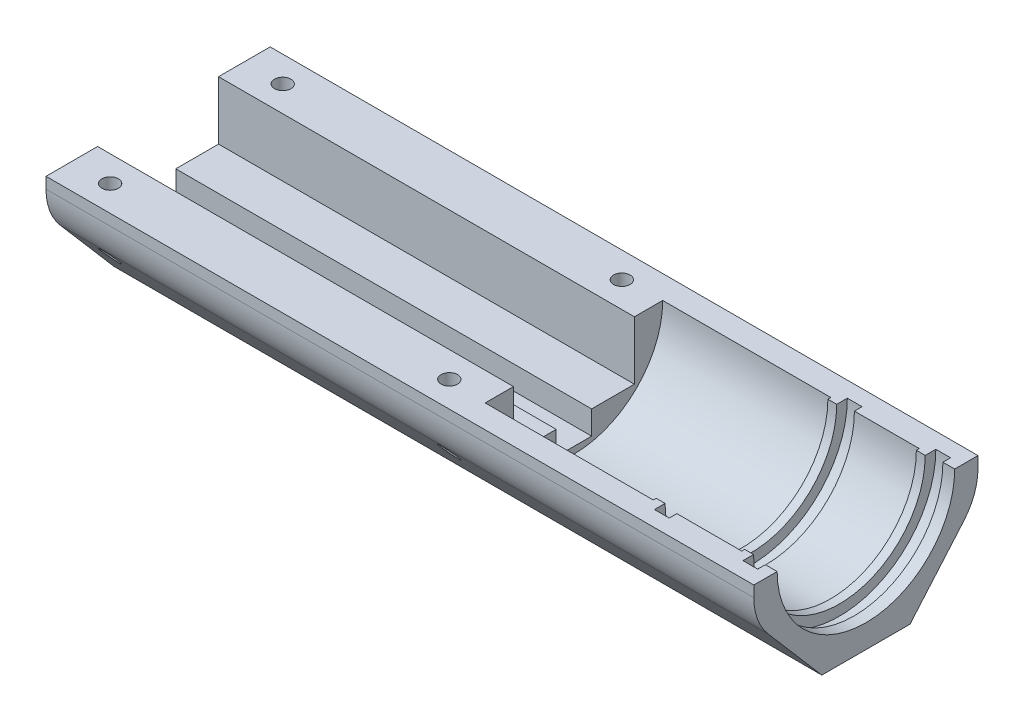
ISO-10303-21;
HEADER;
FILE_DESCRIPTION(('STEP AP214'),'2;1');
FILE_NAME('part.step','',(''),(''),'','','');
FILE_SCHEMA(('AUTOMOTIVE_DESIGN { 1 0 10303 214 1 1 1 1 }'));
ENDSEC;
DATA;
#1=APPLICATION_CONTEXT('core data for automotive mechanical design processes');
#2=APPLICATION_PROTOCOL_DEFINITION('international standard','automotive_design',2000,#1);
#3=PRODUCT_CONTEXT('',#1,'mechanical');
#4=PRODUCT('Part','Part','',(#3));
#5=PRODUCT_RELATED_PRODUCT_CATEGORY('part','',(#4));
#6=PRODUCT_DEFINITION_FORMATION('','',#4);
#7=PRODUCT_DEFINITION_CONTEXT('part definition',#1,'design');
#8=PRODUCT_DEFINITION('design','',#6,#7);
#9=PRODUCT_DEFINITION_SHAPE('','',#8);
#10=(LENGTH_UNIT() NAMED_UNIT(*) SI_UNIT(.MILLI.,.METRE.));
#11=(NAMED_UNIT(*) PLANE_ANGLE_UNIT() SI_UNIT($,.RADIAN.));
#12=(NAMED_UNIT(*) SI_UNIT($,.STERADIAN.) SOLID_ANGLE_UNIT());
#13=UNCERTAINTY_MEASURE_WITH_UNIT(LENGTH_MEASURE(1.E-05),#10,'distance_accuracy_value','');
#14=(GEOMETRIC_REPRESENTATION_CONTEXT(3) GLOBAL_UNCERTAINTY_ASSIGNED_CONTEXT((#13)) GLOBAL_UNIT_ASSIGNED_CONTEXT((#10,
#11,#12)) REPRESENTATION_CONTEXT('',''));
#15=CARTESIAN_POINT('',(0.,0.,0.));
#16=DIRECTION('',(0.,0.,1.));
#17=DIRECTION('',(1.,0.,0.));
#18=AXIS2_PLACEMENT_3D('',#15,#16,#17);
#19=CARTESIAN_POINT('',(0.,0.,-15.05));
#20=DIRECTION('',(-1.,0.,0.));
#21=DIRECTION('',(0.,0.,1.));
#22=AXIS2_PLACEMENT_3D('',#19,#20,#21);
#23=PLANE('',#22);
#24=DIRECTION('',(0.,1.,0.));
#25=VECTOR('',#24,1.);
#26=CARTESIAN_POINT('',(0.,0.,10.25));
#27=LINE('',#26,#25);
#28=CARTESIAN_POINT('',(0.,-9.90000000000001,10.25));
#29=VERTEX_POINT('',#28);
#30=CARTESIAN_POINT('',(0.,0.,10.25));
#31=VERTEX_POINT('',#30);
#32=EDGE_CURVE('E50',#29,#31,#27,.T.);
#33=ORIENTED_EDGE('',*,*,#32,.F.);
#34=DIRECTION('',(0.,0.,1.));
#35=VECTOR('',#34,1.);
#36=CARTESIAN_POINT('',(0.,-9.90000000000001,10.25));
#37=LINE('',#36,#35);
#38=CARTESIAN_POINT('',(0.,-9.89999999999999,3.));
#39=VERTEX_POINT('',#38);
#40=EDGE_CURVE('E390',#39,#29,#37,.T.);
#41=ORIENTED_EDGE('',*,*,#40,.F.);
#42=DIRECTION('',(0.,1.,0.));
#43=VECTOR('',#42,1.);
#44=CARTESIAN_POINT('',(0.,-9.89999999999999,3.));
#45=LINE('',#44,#43);
#46=CARTESIAN_POINT('',(0.,-13.9,3.));
#47=VERTEX_POINT('',#46);
#48=EDGE_CURVE('E387',#47,#39,#45,.T.);
#49=ORIENTED_EDGE('',*,*,#48,.F.);
#50=DIRECTION('',(0.,0.,1.));
#51=VECTOR('',#50,1.);
#52=CARTESIAN_POINT('',(0.,-13.9,-3.));
#53=LINE('',#52,#51);
#54=CARTESIAN_POINT('',(0.,-13.9,-3.));
#55=VERTEX_POINT('',#54);
#56=EDGE_CURVE('E384',#55,#47,#53,.T.);
#57=ORIENTED_EDGE('',*,*,#56,.F.);
#58=DIRECTION('',(0.,-1.,0.));
#59=VECTOR('',#58,1.);
#60=CARTESIAN_POINT('',(0.,-9.9,-2.99999999999999));
#61=LINE('',#60,#59);
#62=CARTESIAN_POINT('',(0.,-9.9,-2.99999999999999));
#63=VERTEX_POINT('',#62);
#64=EDGE_CURVE('E381',#63,#55,#61,.T.);
#65=ORIENTED_EDGE('',*,*,#64,.F.);
#66=DIRECTION('',(0.,0.,1.));
#67=VECTOR('',#66,1.);
#68=CARTESIAN_POINT('',(0.,-9.9,-2.99999999999999));
#69=LINE('',#68,#67);
#70=CARTESIAN_POINT('',(0.,-9.90000000000001,-10.25));
#71=VERTEX_POINT('',#70);
#72=EDGE_CURVE('E252',#71,#63,#69,.T.);
#73=ORIENTED_EDGE('',*,*,#72,.F.);
#74=DIRECTION('',(0.,-1.,0.));
#75=VECTOR('',#74,1.);
#76=CARTESIAN_POINT('',(0.,0.,-10.25));
#77=LINE('',#76,#75);
#78=CARTESIAN_POINT('',(0.,0.,-10.25));
#79=VERTEX_POINT('',#78);
#80=EDGE_CURVE('E236',#79,#71,#77,.T.);
#81=ORIENTED_EDGE('',*,*,#80,.F.);
#82=DIRECTION('',(0.,0.,-1.));
#83=VECTOR('',#82,1.);
#84=CARTESIAN_POINT('',(0.,0.,-15.05));
#85=LINE('',#84,#83);
#86=CARTESIAN_POINT('',(0.,0.,-19.));
#87=VERTEX_POINT('',#86);
#88=EDGE_CURVE('E248',#79,#87,#85,.T.);
#89=ORIENTED_EDGE('',*,*,#88,.T.);
#90=DIRECTION('',(0.,1.,0.));
#91=VECTOR('',#90,1.);
#92=CARTESIAN_POINT('',(0.,0.,-19.));
#93=LINE('',#92,#91);
#94=CARTESIAN_POINT('',(0.,-1.87765266245654,-19.));
#95=VERTEX_POINT('',#94);
#96=EDGE_CURVE('E430',#95,#87,#93,.T.);
#97=ORIENTED_EDGE('',*,*,#96,.F.);
#98=CARTESIAN_POINT('',(0.,-1.87765266245654,-9.));
#99=DIRECTION('',(-1.,0.,0.));
#100=DIRECTION('',(0.,0.,1.));
#101=AXIS2_PLACEMENT_3D('',#98,#99,#100);
#102=CIRCLE('',#101,10.);
#103=CARTESIAN_POINT('',(0.,-8.39458052178645,-16.5848303393214));
#104=VERTEX_POINT('',#103);
#105=EDGE_CURVE('E340',#95,#104,#102,.T.);
#106=ORIENTED_EDGE('',*,*,#105,.T.);
#107=DIRECTION('',(0.,-0.758483033932136,0.651692785932991));
#108=VECTOR('',#107,1.);
#109=CARTESIAN_POINT('',(0.,-4.32387106802505,-20.0824062453935));
#110=LINE('',#109,#108);
#111=CARTESIAN_POINT('',(0.,-19.0000000000001,-7.47259571237857));
#112=VERTEX_POINT('',#111);
#113=EDGE_CURVE('E422',#104,#112,#110,.T.);
#114=ORIENTED_EDGE('',*,*,#113,.T.);
#115=DIRECTION('',(0.,0.,1.));
#116=VECTOR('',#115,1.);
#117=CARTESIAN_POINT('',(0.,-18.9999999999999,25.0500000000001));
#118=LINE('',#117,#116);
#119=CARTESIAN_POINT('',(0.,-19.,7.4725957123786));
#120=VERTEX_POINT('',#119);
#121=EDGE_CURVE('E432',#112,#120,#118,.T.);
#122=ORIENTED_EDGE('',*,*,#121,.T.);
#123=DIRECTION('',(0.,0.758483033932136,0.651692785932991));
#124=VECTOR('',#123,1.);
#125=CARTESIAN_POINT('',(0.,-19.2022385041559,7.2988312795567));
#126=LINE('',#125,#124);
#127=CARTESIAN_POINT('',(0.,-8.39458052178646,16.5848303393214));
#128=VERTEX_POINT('',#127);
#129=EDGE_CURVE('E410',#120,#128,#126,.T.);
#130=ORIENTED_EDGE('',*,*,#129,.T.);
#131=CARTESIAN_POINT('',(0.,-1.87765266245654,9.));
#132=DIRECTION('',(-1.,0.,0.));
#133=DIRECTION('',(0.,0.,1.));
#134=AXIS2_PLACEMENT_3D('',#131,#132,#133);
#135=CIRCLE('',#134,10.);
#136=CARTESIAN_POINT('',(0.,-1.87765266245654,19.));
#137=VERTEX_POINT('',#136);
#138=EDGE_CURVE('E58',#128,#137,#135,.T.);
#139=ORIENTED_EDGE('',*,*,#138,.T.);
#140=DIRECTION('',(0.,-1.,0.));
#141=VECTOR('',#140,1.);
#142=CARTESIAN_POINT('',(0.,0.,19.));
#143=LINE('',#142,#141);
#144=CARTESIAN_POINT('',(0.,0.,19.));
#145=VERTEX_POINT('',#144);
#146=EDGE_CURVE('E417',#145,#137,#143,.T.);
#147=ORIENTED_EDGE('',*,*,#146,.F.);
#148=DIRECTION('',(0.,0.,1.));
#149=VECTOR('',#148,1.);
#150=CARTESIAN_POINT('',(0.,0.,15.05));
#151=LINE('',#150,#149);
#152=EDGE_CURVE('E447',#31,#145,#151,.T.);
#153=ORIENTED_EDGE('',*,*,#152,.F.);
#154=EDGE_LOOP('',(#33,#41,#49,#57,#65,#73,#81,#89,#97,#106,#114,#122,#130,#139,#147,#153));
#155=FACE_BOUND('',#154,.T.);
#156=ADVANCED_FACE('F33',(#155),#23,.T.);
#157=CARTESIAN_POINT('',(120.,0.,-15.05));
#158=DIRECTION('',(1.,0.,0.));
#159=DIRECTION('',(0.,0.,-1.));
#160=AXIS2_PLACEMENT_3D('',#157,#158,#159);
#161=PLANE('',#160);
#162=DIRECTION('',(0.,0.758483033932136,-0.651692785932991));
#163=VECTOR('',#162,1.);
#164=CARTESIAN_POINT('',(120.,-4.32387106802505,-20.0824062453935));
#165=LINE('',#164,#163);
#166=CARTESIAN_POINT('',(120.,-19.0000000000001,-7.47259571237857));
#167=VERTEX_POINT('',#166);
#168=CARTESIAN_POINT('',(120.,-8.39458052178645,-16.5848303393214));
#169=VERTEX_POINT('',#168);
#170=EDGE_CURVE('E419',#167,#169,#165,.T.);
#171=ORIENTED_EDGE('',*,*,#170,.T.);
#172=CARTESIAN_POINT('',(120.,-1.87765266245654,-9.));
#173=DIRECTION('',(1.,0.,0.));
#174=DIRECTION('',(0.,0.,-1.));
#175=AXIS2_PLACEMENT_3D('',#172,#173,#174);
#176=CIRCLE('',#175,10.);
#177=CARTESIAN_POINT('',(120.,-1.87765266245654,-19.));
#178=VERTEX_POINT('',#177);
#179=EDGE_CURVE('E335',#169,#178,#176,.T.);
#180=ORIENTED_EDGE('',*,*,#179,.T.);
#181=DIRECTION('',(0.,-1.,0.));
#182=VECTOR('',#181,1.);
#183=CARTESIAN_POINT('',(120.,0.,-19.));
#184=LINE('',#183,#182);
#185=CARTESIAN_POINT('',(120.,0.,-19.));
#186=VERTEX_POINT('',#185);
#187=EDGE_CURVE('E427',#186,#178,#184,.T.);
#188=ORIENTED_EDGE('',*,*,#187,.F.);
#189=DIRECTION('',(0.,0.,1.));
#190=VECTOR('',#189,1.);
#191=CARTESIAN_POINT('',(120.,0.,-15.05));
#192=LINE('',#191,#190);
#193=CARTESIAN_POINT('',(120.,0.,-15.05));
#194=VERTEX_POINT('',#193);
#195=EDGE_CURVE('E258',#186,#194,#192,.T.);
#196=ORIENTED_EDGE('',*,*,#195,.T.);
#197=CARTESIAN_POINT('',(120.,0.,0.));
#198=DIRECTION('',(-1.,0.,0.));
#199=DIRECTION('',(0.,0.,1.));
#200=AXIS2_PLACEMENT_3D('',#197,#198,#199);
#201=CIRCLE('',#200,15.05);
#202=CARTESIAN_POINT('',(120.,0.,15.05));
#203=VERTEX_POINT('',#202);
#204=EDGE_CURVE('E311',#194,#203,#201,.T.);
#205=ORIENTED_EDGE('',*,*,#204,.T.);
#206=DIRECTION('',(0.,0.,-1.));
#207=VECTOR('',#206,1.);
#208=CARTESIAN_POINT('',(120.,0.,15.05));
#209=LINE('',#208,#207);
#210=CARTESIAN_POINT('',(120.,0.,19.));
#211=VERTEX_POINT('',#210);
#212=EDGE_CURVE('E449',#211,#203,#209,.T.);
#213=ORIENTED_EDGE('',*,*,#212,.F.);
#214=DIRECTION('',(0.,1.,0.));
#215=VECTOR('',#214,1.);
#216=CARTESIAN_POINT('',(120.,0.,19.));
#217=LINE('',#216,#215);
#218=CARTESIAN_POINT('',(120.,-1.87765266245654,19.));
#219=VERTEX_POINT('',#218);
#220=EDGE_CURVE('E415',#219,#211,#217,.T.);
#221=ORIENTED_EDGE('',*,*,#220,.F.);
#222=CARTESIAN_POINT('',(120.,-1.87765266245654,9.));
#223=DIRECTION('',(1.,0.,0.));
#224=DIRECTION('',(0.,0.,-1.));
#225=AXIS2_PLACEMENT_3D('',#222,#223,#224);
#226=CIRCLE('',#225,10.);
#227=CARTESIAN_POINT('',(120.,-8.39458052178645,16.5848303393214));
#228=VERTEX_POINT('',#227);
#229=EDGE_CURVE('E333',#219,#228,#226,.T.);
#230=ORIENTED_EDGE('',*,*,#229,.T.);
#231=DIRECTION('',(0.,-0.758483033932136,-0.651692785932991));
#232=VECTOR('',#231,1.);
#233=CARTESIAN_POINT('',(120.,-19.2022385041559,7.2988312795567));
#234=LINE('',#233,#232);
#235=CARTESIAN_POINT('',(120.,-19.,7.4725957123786));
#236=VERTEX_POINT('',#235);
#237=EDGE_CURVE('E408',#228,#236,#234,.T.);
#238=ORIENTED_EDGE('',*,*,#237,.T.);
#239=DIRECTION('',(0.,0.,1.));
#240=VECTOR('',#239,1.);
#241=CARTESIAN_POINT('',(120.,-19.0000000000001,-15.0499999999999));
#242=LINE('',#241,#240);
#243=EDGE_CURVE('E323',#167,#236,#242,.T.);
#244=ORIENTED_EDGE('',*,*,#243,.F.);
#245=EDGE_LOOP('',(#171,#180,#188,#196,#205,#213,#221,#230,#238,#244));
#246=FACE_BOUND('',#245,.T.);
#247=ADVANCED_FACE('F553',(#246),#161,.T.);
#248=CARTESIAN_POINT('',(0.,-19.,0.));
#249=DIRECTION('',(0.,1.,0.));
#250=DIRECTION('',(0.,0.,1.));
#251=AXIS2_PLACEMENT_3D('',#248,#249,#250);
#252=PLANE('',#251);
#253=DIRECTION('',(1.,0.,0.));
#254=VECTOR('',#253,1.);
#255=CARTESIAN_POINT('',(0.,-19.,7.47259571237864));
#256=LINE('',#255,#254);
#257=EDGE_CURVE('E412',#120,#236,#256,.T.);
#258=ORIENTED_EDGE('',*,*,#257,.F.);
#259=ORIENTED_EDGE('',*,*,#121,.F.);
#260=DIRECTION('',(-1.,0.,0.));
#261=VECTOR('',#260,1.);
#262=CARTESIAN_POINT('',(0.,-19.,-7.4725957123786));
#263=LINE('',#262,#261);
#264=EDGE_CURVE('E424',#167,#112,#263,.T.);
#265=ORIENTED_EDGE('',*,*,#264,.F.);
#266=ORIENTED_EDGE('',*,*,#243,.T.);
#267=EDGE_LOOP('',(#258,#259,#265,#266));
#268=FACE_BOUND('',#267,.T.);
#269=ADVANCED_FACE('F571',(#268),#252,.F.);
#270=CARTESIAN_POINT('',(0.,0.,19.));
#271=DIRECTION('',(0.,0.,-1.));
#272=DIRECTION('',(1.,0.,0.));
#273=AXIS2_PLACEMENT_3D('',#270,#271,#272);
#274=PLANE('',#273);
#275=ORIENTED_EDGE('',*,*,#146,.T.);
#276=DIRECTION('',(-1.,0.,0.));
#277=VECTOR('',#276,1.);
#278=CARTESIAN_POINT('',(120.,-1.87765266245654,19.));
#279=LINE('',#278,#277);
#280=EDGE_CURVE('E345',#137,#219,#279,.F.);
#281=ORIENTED_EDGE('',*,*,#280,.T.);
#282=ORIENTED_EDGE('',*,*,#220,.T.);
#283=DIRECTION('',(-1.,0.,0.));
#284=VECTOR('',#283,1.);
#285=CARTESIAN_POINT('',(0.,0.,19.));
#286=LINE('',#285,#284);
#287=EDGE_CURVE('E327',#211,#145,#286,.T.);
#288=ORIENTED_EDGE('',*,*,#287,.T.);
#289=EDGE_LOOP('',(#275,#281,#282,#288));
#290=FACE_BOUND('',#289,.T.);
#291=ADVANCED_FACE('F580',(#290),#274,.F.);
#292=CARTESIAN_POINT('',(0.,0.,-19.));
#293=DIRECTION('',(0.,0.,1.));
#294=DIRECTION('',(1.,0.,0.));
#295=AXIS2_PLACEMENT_3D('',#292,#293,#294);
#296=PLANE('',#295);
#297=ORIENTED_EDGE('',*,*,#187,.T.);
#298=DIRECTION('',(1.,0.,0.));
#299=VECTOR('',#298,1.);
#300=CARTESIAN_POINT('',(0.,-1.87765266245654,-19.));
#301=LINE('',#300,#299);
#302=EDGE_CURVE('E337',#178,#95,#301,.F.);
#303=ORIENTED_EDGE('',*,*,#302,.T.);
#304=ORIENTED_EDGE('',*,*,#96,.T.);
#305=DIRECTION('',(-1.,0.,0.));
#306=VECTOR('',#305,1.);
#307=CARTESIAN_POINT('',(0.,0.,-19.));
#308=LINE('',#307,#306);
#309=EDGE_CURVE('E257',#186,#87,#308,.T.);
#310=ORIENTED_EDGE('',*,*,#309,.F.);
#311=EDGE_LOOP('',(#297,#303,#304,#310));
#312=FACE_BOUND('',#311,.T.);
#313=ADVANCED_FACE('F558',(#312),#296,.F.);
#314=CARTESIAN_POINT('',(0.,0.,0.));
#315=DIRECTION('',(-1.,0.,0.));
#316=DIRECTION('',(0.,0.,1.));
#317=AXIS2_PLACEMENT_3D('',#314,#315,#316);
#318=CYLINDRICAL_SURFACE('',#317,14.55);
#319=CARTESIAN_POINT('',(99.,0.,0.));
#320=DIRECTION('',(-1.,0.,0.));
#321=DIRECTION('',(0.,0.,1.));
#322=AXIS2_PLACEMENT_3D('',#319,#320,#321);
#323=CIRCLE('',#322,14.55);
#324=CARTESIAN_POINT('',(99.,0.,-14.55));
#325=VERTEX_POINT('',#324);
#326=CARTESIAN_POINT('',(99.,0.,14.55));
#327=VERTEX_POINT('',#326);
#328=EDGE_CURVE('E318',#325,#327,#323,.T.);
#329=ORIENTED_EDGE('',*,*,#328,.T.);
#330=DIRECTION('',(-1.,0.,0.));
#331=VECTOR('',#330,1.);
#332=CARTESIAN_POINT('',(100.5,0.,14.55));
#333=LINE('',#332,#331);
#334=CARTESIAN_POINT('',(100.5,0.,14.55));
#335=VERTEX_POINT('',#334);
#336=EDGE_CURVE('E435',#335,#327,#333,.T.);
#337=ORIENTED_EDGE('',*,*,#336,.F.);
#338=CARTESIAN_POINT('',(100.5,0.,0.));
#339=DIRECTION('',(-1.,0.,0.));
#340=DIRECTION('',(0.,0.,1.));
#341=AXIS2_PLACEMENT_3D('',#338,#339,#340);
#342=CIRCLE('',#341,14.55);
#343=CARTESIAN_POINT('',(100.5,0.,-14.55));
#344=VERTEX_POINT('',#343);
#345=EDGE_CURVE('E320',#344,#335,#342,.T.);
#346=ORIENTED_EDGE('',*,*,#345,.F.);
#347=DIRECTION('',(-1.,0.,0.));
#348=VECTOR('',#347,1.);
#349=CARTESIAN_POINT('',(100.5,0.,-14.55));
#350=LINE('',#349,#348);
#351=EDGE_CURVE('E482',#344,#325,#350,.T.);
#352=ORIENTED_EDGE('',*,*,#351,.T.);
#353=EDGE_LOOP('',(#329,#337,#346,#352));
#354=FACE_BOUND('',#353,.T.);
#355=ADVANCED_FACE('F510',(#354),#318,.F.);
#356=CARTESIAN_POINT('',(99.,0.,-15.05));
#357=DIRECTION('',(-1.,0.,0.));
#358=DIRECTION('',(0.,0.,1.));
#359=AXIS2_PLACEMENT_3D('',#356,#357,#358);
#360=PLANE('',#359);
#361=CARTESIAN_POINT('',(99.,0.,0.));
#362=DIRECTION('',(-1.,0.,0.));
#363=DIRECTION('',(0.,0.,1.));
#364=AXIS2_PLACEMENT_3D('',#361,#362,#363);
#365=CIRCLE('',#364,15.05);
#366=CARTESIAN_POINT('',(99.,0.,-15.05));
#367=VERTEX_POINT('',#366);
#368=CARTESIAN_POINT('',(99.,0.,15.05));
#369=VERTEX_POINT('',#368);
#370=EDGE_CURVE('E316',#367,#369,#365,.T.);
#371=ORIENTED_EDGE('',*,*,#370,.T.);
#372=DIRECTION('',(0.,0.,1.));
#373=VECTOR('',#372,1.);
#374=CARTESIAN_POINT('',(99.,0.,15.05));
#375=LINE('',#374,#373);
#376=EDGE_CURVE('E438',#327,#369,#375,.T.);
#377=ORIENTED_EDGE('',*,*,#376,.F.);
#378=ORIENTED_EDGE('',*,*,#328,.F.);
#379=DIRECTION('',(0.,0.,-1.));
#380=VECTOR('',#379,1.);
#381=CARTESIAN_POINT('',(99.,0.,-15.05));
#382=LINE('',#381,#380);
#383=EDGE_CURVE('E485',#325,#367,#382,.T.);
#384=ORIENTED_EDGE('',*,*,#383,.T.);
#385=EDGE_LOOP('',(#371,#377,#378,#384));
#386=FACE_BOUND('',#385,.T.);
#387=ADVANCED_FACE('F505',(#386),#360,.T.);
#388=CARTESIAN_POINT('',(0.,0.,0.));
#389=DIRECTION('',(-1.,0.,0.));
#390=DIRECTION('',(0.,0.,1.));
#391=AXIS2_PLACEMENT_3D('',#388,#389,#390);
#392=CYLINDRICAL_SURFACE('',#391,15.05);
#393=CARTESIAN_POINT('',(70.5,0.,0.));
#394=DIRECTION('',(-1.,0.,0.));
#395=DIRECTION('',(0.,0.,1.));
#396=AXIS2_PLACEMENT_3D('',#393,#394,#395);
#397=CIRCLE('',#396,15.05);
#398=CARTESIAN_POINT('',(70.5,0.,-15.05));
#399=VERTEX_POINT('',#398);
#400=CARTESIAN_POINT('',(70.5,0.,15.05));
#401=VERTEX_POINT('',#400);
#402=EDGE_CURVE('E314',#399,#401,#397,.T.);
#403=ORIENTED_EDGE('',*,*,#402,.T.);
#404=DIRECTION('',(-1.,0.,0.));
#405=VECTOR('',#404,1.);
#406=CARTESIAN_POINT('',(70.5,0.,15.05));
#407=LINE('',#406,#405);
#408=EDGE_CURVE('E441',#369,#401,#407,.T.);
#409=ORIENTED_EDGE('',*,*,#408,.F.);
#410=ORIENTED_EDGE('',*,*,#370,.F.);
#411=DIRECTION('',(-1.,0.,0.));
#412=VECTOR('',#411,1.);
#413=CARTESIAN_POINT('',(70.5,0.,-15.05));
#414=LINE('',#413,#412);
#415=EDGE_CURVE('E263',#367,#399,#414,.T.);
#416=ORIENTED_EDGE('',*,*,#415,.T.);
#417=EDGE_LOOP('',(#403,#409,#410,#416));
#418=FACE_BOUND('',#417,.T.);
#419=ADVANCED_FACE('F490',(#418),#392,.F.);
#420=CARTESIAN_POINT('',(70.5,0.,-15.05));
#421=DIRECTION('',(1.,0.,0.));
#422=DIRECTION('',(0.,0.,-1.));
#423=AXIS2_PLACEMENT_3D('',#420,#421,#422);
#424=PLANE('',#423);
#425=DIRECTION('',(0.,-1.,0.));
#426=VECTOR('',#425,1.);
#427=CARTESIAN_POINT('',(70.5,0.,10.25));
#428=LINE('',#427,#426);
#429=CARTESIAN_POINT('',(70.5,0.,10.25));
#430=VERTEX_POINT('',#429);
#431=CARTESIAN_POINT('',(70.5,-9.90000000000001,10.25));
#432=VERTEX_POINT('',#431);
#433=EDGE_CURVE('E396',#430,#432,#428,.T.);
#434=ORIENTED_EDGE('',*,*,#433,.F.);
#435=DIRECTION('',(0.,0.,-1.));
#436=VECTOR('',#435,1.);
#437=CARTESIAN_POINT('',(70.5,0.,15.05));
#438=LINE('',#437,#436);
#439=EDGE_CURVE('E444',#401,#430,#438,.T.);
#440=ORIENTED_EDGE('',*,*,#439,.F.);
#441=ORIENTED_EDGE('',*,*,#402,.F.);
#442=DIRECTION('',(0.,0.,1.));
#443=VECTOR('',#442,1.);
#444=CARTESIAN_POINT('',(70.5,0.,-15.05));
#445=LINE('',#444,#443);
#446=CARTESIAN_POINT('',(70.5,0.,-10.25));
#447=VERTEX_POINT('',#446);
#448=EDGE_CURVE('E259',#399,#447,#445,.T.);
#449=ORIENTED_EDGE('',*,*,#448,.T.);
#450=DIRECTION('',(0.,1.,0.));
#451=VECTOR('',#450,1.);
#452=CARTESIAN_POINT('',(70.5,0.,-10.25));
#453=LINE('',#452,#451);
#454=CARTESIAN_POINT('',(70.5,-9.90000000000001,-10.25));
#455=VERTEX_POINT('',#454);
#456=EDGE_CURVE('E239',#455,#447,#453,.T.);
#457=ORIENTED_EDGE('',*,*,#456,.F.);
#458=DIRECTION('',(0.,0.,-1.));
#459=VECTOR('',#458,1.);
#460=CARTESIAN_POINT('',(70.5,-9.90000000000001,-15.05));
#461=LINE('',#460,#459);
#462=CARTESIAN_POINT('',(70.5,-9.9,-2.99999999999999));
#463=VERTEX_POINT('',#462);
#464=EDGE_CURVE('E244',#463,#455,#461,.T.);
#465=ORIENTED_EDGE('',*,*,#464,.F.);
#466=DIRECTION('',(0.,1.,0.));
#467=VECTOR('',#466,1.);
#468=CARTESIAN_POINT('',(70.5,0.,-2.99999999999996));
#469=LINE('',#468,#467);
#470=CARTESIAN_POINT('',(70.5,-13.9,-3.));
#471=VERTEX_POINT('',#470);
#472=EDGE_CURVE('E349',#471,#463,#469,.T.);
#473=ORIENTED_EDGE('',*,*,#472,.F.);
#474=DIRECTION('',(0.,0.,-1.));
#475=VECTOR('',#474,1.);
#476=CARTESIAN_POINT('',(70.5,-13.9,-15.05));
#477=LINE('',#476,#475);
#478=CARTESIAN_POINT('',(70.5,-13.9,3.));
#479=VERTEX_POINT('',#478);
#480=EDGE_CURVE('E351',#479,#471,#477,.T.);
#481=ORIENTED_EDGE('',*,*,#480,.F.);
#482=DIRECTION('',(0.,-1.,0.));
#483=VECTOR('',#482,1.);
#484=CARTESIAN_POINT('',(70.5,0.,3.));
#485=LINE('',#484,#483);
#486=CARTESIAN_POINT('',(70.5,-9.89999999999999,3.));
#487=VERTEX_POINT('',#486);
#488=EDGE_CURVE('E42',#487,#479,#485,.T.);
#489=ORIENTED_EDGE('',*,*,#488,.F.);
#490=DIRECTION('',(0.,0.,-1.));
#491=VECTOR('',#490,1.);
#492=CARTESIAN_POINT('',(70.5,-9.89999999999994,-15.05));
#493=LINE('',#492,#491);
#494=EDGE_CURVE('E11',#432,#487,#493,.T.);
#495=ORIENTED_EDGE('',*,*,#494,.F.);
#496=EDGE_LOOP('',(#434,#440,#441,#449,#457,#465,#473,#481,#489,#495));
#497=FACE_BOUND('',#496,.T.);
#498=ADVANCED_FACE('F495',(#497),#424,.T.);
#499=CARTESIAN_POINT('',(0.,0.,0.));
#500=DIRECTION('',(-1.,0.,0.));
#501=DIRECTION('',(0.,0.,1.));
#502=AXIS2_PLACEMENT_3D('',#499,#500,#501);
#503=CYLINDRICAL_SURFACE('',#502,15.05);
#504=CARTESIAN_POINT('',(118.,0.,0.));
#505=DIRECTION('',(-1.,0.,0.));
#506=DIRECTION('',(0.,0.,1.));
#507=AXIS2_PLACEMENT_3D('',#504,#505,#506);
#508=CIRCLE('',#507,15.05);
#509=CARTESIAN_POINT('',(118.,0.,-15.05));
#510=VERTEX_POINT('',#509);
#511=CARTESIAN_POINT('',(118.,0.,15.05));
#512=VERTEX_POINT('',#511);
#513=EDGE_CURVE('E309',#510,#512,#508,.T.);
#514=ORIENTED_EDGE('',*,*,#513,.T.);
#515=DIRECTION('',(-1.,0.,0.));
#516=VECTOR('',#515,1.);
#517=CARTESIAN_POINT('',(118.,0.,15.05));
#518=LINE('',#517,#516);
#519=EDGE_CURVE('E451',#203,#512,#518,.T.);
#520=ORIENTED_EDGE('',*,*,#519,.F.);
#521=ORIENTED_EDGE('',*,*,#204,.F.);
#522=DIRECTION('',(-1.,0.,0.));
#523=VECTOR('',#522,1.);
#524=CARTESIAN_POINT('',(118.,0.,-15.05));
#525=LINE('',#524,#523);
#526=EDGE_CURVE('E261',#194,#510,#525,.T.);
#527=ORIENTED_EDGE('',*,*,#526,.T.);
#528=EDGE_LOOP('',(#514,#520,#521,#527));
#529=FACE_BOUND('',#528,.T.);
#530=ADVANCED_FACE('F550',(#529),#503,.F.);
#531=CARTESIAN_POINT('',(118.,0.,-15.05));
#532=DIRECTION('',(-1.,0.,0.));
#533=DIRECTION('',(0.,0.,1.));
#534=AXIS2_PLACEMENT_3D('',#531,#532,#533);
#535=PLANE('',#534);
#536=CARTESIAN_POINT('',(118.,0.,0.));
#537=DIRECTION('',(-1.,0.,0.));
#538=DIRECTION('',(0.,0.,1.));
#539=AXIS2_PLACEMENT_3D('',#536,#537,#538);
#540=CIRCLE('',#539,16.35);
#541=CARTESIAN_POINT('',(118.,0.,-16.35));
#542=VERTEX_POINT('',#541);
#543=CARTESIAN_POINT('',(118.,0.,16.35));
#544=VERTEX_POINT('',#543);
#545=EDGE_CURVE('E307',#542,#544,#540,.T.);
#546=ORIENTED_EDGE('',*,*,#545,.T.);
#547=DIRECTION('',(0.,0.,1.));
#548=VECTOR('',#547,1.);
#549=CARTESIAN_POINT('',(118.,0.,15.05));
#550=LINE('',#549,#548);
#551=EDGE_CURVE('E454',#512,#544,#550,.T.);
#552=ORIENTED_EDGE('',*,*,#551,.F.);
#553=ORIENTED_EDGE('',*,*,#513,.F.);
#554=DIRECTION('',(0.,0.,-1.));
#555=VECTOR('',#554,1.);
#556=CARTESIAN_POINT('',(118.,0.,-15.05));
#557=LINE('',#556,#555);
#558=EDGE_CURVE('E269',#510,#542,#557,.T.);
#559=ORIENTED_EDGE('',*,*,#558,.T.);
#560=EDGE_LOOP('',(#546,#552,#553,#559));
#561=FACE_BOUND('',#560,.T.);
#562=ADVANCED_FACE('F545',(#561),#535,.T.);
#563=CARTESIAN_POINT('',(0.,0.,0.));
#564=DIRECTION('',(-1.,0.,0.));
#565=DIRECTION('',(0.,0.,1.));
#566=AXIS2_PLACEMENT_3D('',#563,#564,#565);
#567=CYLINDRICAL_SURFACE('',#566,16.35);
#568=CARTESIAN_POINT('',(115.5,0.,0.));
#569=DIRECTION('',(-1.,0.,0.));
#570=DIRECTION('',(0.,0.,1.));
#571=AXIS2_PLACEMENT_3D('',#568,#569,#570);
#572=CIRCLE('',#571,16.35);
#573=CARTESIAN_POINT('',(115.5,0.,-16.35));
#574=VERTEX_POINT('',#573);
#575=CARTESIAN_POINT('',(115.5,0.,16.35));
#576=VERTEX_POINT('',#575);
#577=EDGE_CURVE('E305',#574,#576,#572,.T.);
#578=ORIENTED_EDGE('',*,*,#577,.T.);
#579=DIRECTION('',(-1.,0.,0.));
#580=VECTOR('',#579,1.);
#581=CARTESIAN_POINT('',(115.5,0.,16.35));
#582=LINE('',#581,#580);
#583=EDGE_CURVE('E457',#544,#576,#582,.T.);
#584=ORIENTED_EDGE('',*,*,#583,.F.);
#585=ORIENTED_EDGE('',*,*,#545,.F.);
#586=DIRECTION('',(-1.,0.,0.));
#587=VECTOR('',#586,1.);
#588=CARTESIAN_POINT('',(115.5,0.,-16.35));
#589=LINE('',#588,#587);
#590=EDGE_CURVE('E272',#542,#574,#589,.T.);
#591=ORIENTED_EDGE('',*,*,#590,.T.);
#592=EDGE_LOOP('',(#578,#584,#585,#591));
#593=FACE_BOUND('',#592,.T.);
#594=ADVANCED_FACE('F541',(#593),#567,.F.);
#595=CARTESIAN_POINT('',(115.5,0.,-15.05));
#596=DIRECTION('',(1.,0.,0.));
#597=DIRECTION('',(0.,0.,-1.));
#598=AXIS2_PLACEMENT_3D('',#595,#596,#597);
#599=PLANE('',#598);
#600=CARTESIAN_POINT('',(115.5,0.,0.));
#601=DIRECTION('',(-1.,0.,0.));
#602=DIRECTION('',(0.,0.,1.));
#603=AXIS2_PLACEMENT_3D('',#600,#601,#602);
#604=CIRCLE('',#603,14.55);
#605=CARTESIAN_POINT('',(115.5,0.,-14.55));
#606=VERTEX_POINT('',#605);
#607=CARTESIAN_POINT('',(115.5,0.,14.55));
#608=VERTEX_POINT('',#607);
#609=EDGE_CURVE('E302',#606,#608,#604,.T.);
#610=ORIENTED_EDGE('',*,*,#609,.T.);
#611=DIRECTION('',(0.,0.,-1.));
#612=VECTOR('',#611,1.);
#613=CARTESIAN_POINT('',(115.5,0.,15.05));
#614=LINE('',#613,#612);
#615=EDGE_CURVE('E460',#576,#608,#614,.T.);
#616=ORIENTED_EDGE('',*,*,#615,.F.);
#617=ORIENTED_EDGE('',*,*,#577,.F.);
#618=DIRECTION('',(0.,0.,1.));
#619=VECTOR('',#618,1.);
#620=CARTESIAN_POINT('',(115.5,0.,-15.05));
#621=LINE('',#620,#619);
#622=EDGE_CURVE('E275',#574,#606,#621,.T.);
#623=ORIENTED_EDGE('',*,*,#622,.T.);
#624=EDGE_LOOP('',(#610,#616,#617,#623));
#625=FACE_BOUND('',#624,.T.);
#626=ADVANCED_FACE('F538',(#625),#599,.T.);
#627=CARTESIAN_POINT('',(0.,0.,0.));
#628=DIRECTION('',(-1.,0.,0.));
#629=DIRECTION('',(0.,0.,1.));
#630=AXIS2_PLACEMENT_3D('',#627,#628,#629);
#631=CYLINDRICAL_SURFACE('',#630,14.55);
#632=CARTESIAN_POINT('',(114.,0.,0.));
#633=DIRECTION('',(-1.,0.,0.));
#634=DIRECTION('',(0.,0.,1.));
#635=AXIS2_PLACEMENT_3D('',#632,#633,#634);
#636=CIRCLE('',#635,14.55);
#637=CARTESIAN_POINT('',(114.,0.,-14.55));
#638=VERTEX_POINT('',#637);
#639=CARTESIAN_POINT('',(114.,0.,14.55));
#640=VERTEX_POINT('',#639);
#641=EDGE_CURVE('E300',#638,#640,#636,.T.);
#642=ORIENTED_EDGE('',*,*,#641,.T.);
#643=DIRECTION('',(-1.,0.,0.));
#644=VECTOR('',#643,1.);
#645=CARTESIAN_POINT('',(115.5,0.,14.55));
#646=LINE('',#645,#644);
#647=EDGE_CURVE('E462',#608,#640,#646,.T.);
#648=ORIENTED_EDGE('',*,*,#647,.F.);
#649=ORIENTED_EDGE('',*,*,#609,.F.);
#650=DIRECTION('',(-1.,0.,0.));
#651=VECTOR('',#650,1.);
#652=CARTESIAN_POINT('',(115.5,0.,-14.55));
#653=LINE('',#652,#651);
#654=EDGE_CURVE('E277',#606,#638,#653,.T.);
#655=ORIENTED_EDGE('',*,*,#654,.T.);
#656=EDGE_LOOP('',(#642,#648,#649,#655));
#657=FACE_BOUND('',#656,.T.);
#658=ADVANCED_FACE('F534',(#657),#631,.F.);
#659=CARTESIAN_POINT('',(114.,0.,-15.05));
#660=DIRECTION('',(-1.,0.,0.));
#661=DIRECTION('',(0.,0.,1.));
#662=AXIS2_PLACEMENT_3D('',#659,#660,#661);
#663=PLANE('',#662);
#664=CARTESIAN_POINT('',(114.,0.,0.));
#665=DIRECTION('',(-1.,0.,0.));
#666=DIRECTION('',(0.,0.,1.));
#667=AXIS2_PLACEMENT_3D('',#664,#665,#666);
#668=CIRCLE('',#667,15.05);
#669=CARTESIAN_POINT('',(114.,0.,-15.05));
#670=VERTEX_POINT('',#669);
#671=CARTESIAN_POINT('',(114.,0.,15.05));
#672=VERTEX_POINT('',#671);
#673=EDGE_CURVE('E298',#670,#672,#668,.T.);
#674=ORIENTED_EDGE('',*,*,#673,.T.);
#675=DIRECTION('',(0.,0.,1.));
#676=VECTOR('',#675,1.);
#677=CARTESIAN_POINT('',(114.,0.,15.05));
#678=LINE('',#677,#676);
#679=EDGE_CURVE('E465',#640,#672,#678,.T.);
#680=ORIENTED_EDGE('',*,*,#679,.F.);
#681=ORIENTED_EDGE('',*,*,#641,.F.);
#682=DIRECTION('',(0.,0.,-1.));
#683=VECTOR('',#682,1.);
#684=CARTESIAN_POINT('',(114.,0.,-15.05));
#685=LINE('',#684,#683);
#686=EDGE_CURVE('E280',#638,#670,#685,.T.);
#687=ORIENTED_EDGE('',*,*,#686,.T.);
#688=EDGE_LOOP('',(#674,#680,#681,#687));
#689=FACE_BOUND('',#688,.T.);
#690=ADVANCED_FACE('F528',(#689),#663,.T.);
#691=CARTESIAN_POINT('',(0.,0.,0.));
#692=DIRECTION('',(-1.,0.,0.));
#693=DIRECTION('',(0.,0.,1.));
#694=AXIS2_PLACEMENT_3D('',#691,#692,#693);
#695=CYLINDRICAL_SURFACE('',#694,15.05);
#696=CARTESIAN_POINT('',(103.,0.,0.));
#697=DIRECTION('',(-1.,0.,0.));
#698=DIRECTION('',(0.,0.,1.));
#699=AXIS2_PLACEMENT_3D('',#696,#697,#698);
#700=CIRCLE('',#699,15.05);
#701=CARTESIAN_POINT('',(103.,0.,-15.05));
#702=VERTEX_POINT('',#701);
#703=CARTESIAN_POINT('',(103.,0.,15.05));
#704=VERTEX_POINT('',#703);
#705=EDGE_CURVE('E296',#702,#704,#700,.T.);
#706=ORIENTED_EDGE('',*,*,#705,.T.);
#707=DIRECTION('',(-1.,0.,0.));
#708=VECTOR('',#707,1.);
#709=CARTESIAN_POINT('',(103.,0.,15.05));
#710=LINE('',#709,#708);
#711=EDGE_CURVE('E468',#672,#704,#710,.T.);
#712=ORIENTED_EDGE('',*,*,#711,.F.);
#713=ORIENTED_EDGE('',*,*,#673,.F.);
#714=DIRECTION('',(-1.,0.,0.));
#715=VECTOR('',#714,1.);
#716=CARTESIAN_POINT('',(103.,0.,-15.05));
#717=LINE('',#716,#715);
#718=EDGE_CURVE('E283',#670,#702,#717,.T.);
#719=ORIENTED_EDGE('',*,*,#718,.T.);
#720=EDGE_LOOP('',(#706,#712,#713,#719));
#721=FACE_BOUND('',#720,.T.);
#722=ADVANCED_FACE('F525',(#721),#695,.F.);
#723=CARTESIAN_POINT('',(103.,0.,-15.05));
#724=DIRECTION('',(-1.,0.,0.));
#725=DIRECTION('',(0.,0.,1.));
#726=AXIS2_PLACEMENT_3D('',#723,#724,#725);
#727=PLANE('',#726);
#728=CARTESIAN_POINT('',(103.,0.,0.));
#729=DIRECTION('',(-1.,0.,0.));
#730=DIRECTION('',(0.,0.,1.));
#731=AXIS2_PLACEMENT_3D('',#728,#729,#730);
#732=CIRCLE('',#731,16.35);
#733=CARTESIAN_POINT('',(103.,0.,-16.35));
#734=VERTEX_POINT('',#733);
#735=CARTESIAN_POINT('',(103.,0.,16.35));
#736=VERTEX_POINT('',#735);
#737=EDGE_CURVE('E294',#734,#736,#732,.T.);
#738=ORIENTED_EDGE('',*,*,#737,.T.);
#739=DIRECTION('',(0.,0.,1.));
#740=VECTOR('',#739,1.);
#741=CARTESIAN_POINT('',(103.,0.,15.05));
#742=LINE('',#741,#740);
#743=EDGE_CURVE('E471',#704,#736,#742,.T.);
#744=ORIENTED_EDGE('',*,*,#743,.F.);
#745=ORIENTED_EDGE('',*,*,#705,.F.);
#746=DIRECTION('',(0.,0.,-1.));
#747=VECTOR('',#746,1.);
#748=CARTESIAN_POINT('',(103.,0.,-15.05));
#749=LINE('',#748,#747);
#750=EDGE_CURVE('E286',#702,#734,#749,.T.);
#751=ORIENTED_EDGE('',*,*,#750,.T.);
#752=EDGE_LOOP('',(#738,#744,#745,#751));
#753=FACE_BOUND('',#752,.T.);
#754=ADVANCED_FACE('F521',(#753),#727,.T.);
#755=CARTESIAN_POINT('',(0.,0.,0.));
#756=DIRECTION('',(-1.,0.,0.));
#757=DIRECTION('',(0.,0.,1.));
#758=AXIS2_PLACEMENT_3D('',#755,#756,#757);
#759=CYLINDRICAL_SURFACE('',#758,16.35);
#760=CARTESIAN_POINT('',(100.5,0.,0.));
#761=DIRECTION('',(-1.,0.,0.));
#762=DIRECTION('',(0.,0.,1.));
#763=AXIS2_PLACEMENT_3D('',#760,#761,#762);
#764=CIRCLE('',#763,16.35);
#765=CARTESIAN_POINT('',(100.5,0.,-16.35));
#766=VERTEX_POINT('',#765);
#767=CARTESIAN_POINT('',(100.5,0.,16.35));
#768=VERTEX_POINT('',#767);
#769=EDGE_CURVE('E292',#766,#768,#764,.T.);
#770=ORIENTED_EDGE('',*,*,#769,.T.);
#771=DIRECTION('',(-1.,0.,0.));
#772=VECTOR('',#771,1.);
#773=CARTESIAN_POINT('',(100.5,0.,16.35));
#774=LINE('',#773,#772);
#775=EDGE_CURVE('E474',#736,#768,#774,.T.);
#776=ORIENTED_EDGE('',*,*,#775,.F.);
#777=ORIENTED_EDGE('',*,*,#737,.F.);
#778=DIRECTION('',(-1.,0.,0.));
#779=VECTOR('',#778,1.);
#780=CARTESIAN_POINT('',(100.5,0.,-16.35));
#781=LINE('',#780,#779);
#782=EDGE_CURVE('E289',#734,#766,#781,.T.);
#783=ORIENTED_EDGE('',*,*,#782,.T.);
#784=EDGE_LOOP('',(#770,#776,#777,#783));
#785=FACE_BOUND('',#784,.T.);
#786=ADVANCED_FACE('F516',(#785),#759,.F.);
#787=CARTESIAN_POINT('',(100.5,0.,-15.05));
#788=DIRECTION('',(1.,0.,0.));
#789=DIRECTION('',(0.,0.,-1.));
#790=AXIS2_PLACEMENT_3D('',#787,#788,#789);
#791=PLANE('',#790);
#792=ORIENTED_EDGE('',*,*,#769,.F.);
#793=DIRECTION('',(0.,0.,1.));
#794=VECTOR('',#793,1.);
#795=CARTESIAN_POINT('',(100.5,0.,-15.05));
#796=LINE('',#795,#794);
#797=EDGE_CURVE('E479',#766,#344,#796,.T.);
#798=ORIENTED_EDGE('',*,*,#797,.T.);
#799=ORIENTED_EDGE('',*,*,#345,.T.);
#800=DIRECTION('',(0.,0.,-1.));
#801=VECTOR('',#800,1.);
#802=CARTESIAN_POINT('',(100.5,0.,15.05));
#803=LINE('',#802,#801);
#804=EDGE_CURVE('E477',#768,#335,#803,.T.);
#805=ORIENTED_EDGE('',*,*,#804,.F.);
#806=EDGE_LOOP('',(#792,#798,#799,#805));
#807=FACE_BOUND('',#806,.T.);
#808=ADVANCED_FACE('F513',(#807),#791,.T.);
#809=CARTESIAN_POINT('',(0.,0.,0.));
#810=DIRECTION('',(0.,-1.,0.));
#811=DIRECTION('',(1.,0.,0.));
#812=AXIS2_PLACEMENT_3D('',#809,#810,#811);
#813=PLANE('',#812);
#814=CARTESIAN_POINT('',(6.5,0.,-14.625));
#815=DIRECTION('',(0.,1.,0.));
#816=DIRECTION('',(0.,0.,1.));
#817=AXIS2_PLACEMENT_3D('',#814,#815,#816);
#818=CIRCLE('',#817,1.4);
#819=CARTESIAN_POINT('',(6.5,0.,-13.225));
#820=VERTEX_POINT('',#819);
#821=EDGE_CURVE('E358',#820,#820,#818,.T.);
#822=ORIENTED_EDGE('',*,*,#821,.F.);
#823=EDGE_LOOP('',(#822));
#824=FACE_BOUND('',#823,.T.);
#825=CARTESIAN_POINT('',(64.,0.,-14.625));
#826=DIRECTION('',(0.,1.,0.));
#827=DIRECTION('',(0.,0.,1.));
#828=AXIS2_PLACEMENT_3D('',#825,#826,#827);
#829=CIRCLE('',#828,1.4);
#830=CARTESIAN_POINT('',(64.,0.,-13.225));
#831=VERTEX_POINT('',#830);
#832=EDGE_CURVE('E366',#831,#831,#829,.T.);
#833=ORIENTED_EDGE('',*,*,#832,.F.);
#834=EDGE_LOOP('',(#833));
#835=FACE_BOUND('',#834,.T.);
#836=ORIENTED_EDGE('',*,*,#88,.F.);
#837=DIRECTION('',(1.,0.,0.));
#838=VECTOR('',#837,1.);
#839=CARTESIAN_POINT('',(0.,0.,-10.25));
#840=LINE('',#839,#838);
#841=EDGE_CURVE('E232',#79,#447,#840,.T.);
#842=ORIENTED_EDGE('',*,*,#841,.T.);
#843=ORIENTED_EDGE('',*,*,#448,.F.);
#844=ORIENTED_EDGE('',*,*,#415,.F.);
#845=ORIENTED_EDGE('',*,*,#383,.F.);
#846=ORIENTED_EDGE('',*,*,#351,.F.);
#847=ORIENTED_EDGE('',*,*,#797,.F.);
#848=ORIENTED_EDGE('',*,*,#782,.F.);
#849=ORIENTED_EDGE('',*,*,#750,.F.);
#850=ORIENTED_EDGE('',*,*,#718,.F.);
#851=ORIENTED_EDGE('',*,*,#686,.F.);
#852=ORIENTED_EDGE('',*,*,#654,.F.);
#853=ORIENTED_EDGE('',*,*,#622,.F.);
#854=ORIENTED_EDGE('',*,*,#590,.F.);
#855=ORIENTED_EDGE('',*,*,#558,.F.);
#856=ORIENTED_EDGE('',*,*,#526,.F.);
#857=ORIENTED_EDGE('',*,*,#195,.F.);
#858=ORIENTED_EDGE('',*,*,#309,.T.);
#859=EDGE_LOOP('',(#836,#842,#843,#844,#845,#846,#847,#848,#849,#850,#851,#852,#853,#854,#855,
#856,#857,#858));
#860=FACE_BOUND('',#859,.T.);
#861=ADVANCED_FACE('F255',(#824,#835,#860),#813,.F.);
#862=CARTESIAN_POINT('',(0.,0.,0.));
#863=DIRECTION('',(0.,1.,0.));
#864=DIRECTION('',(1.,0.,0.));
#865=AXIS2_PLACEMENT_3D('',#862,#863,#864);
#866=PLANE('',#865);
#867=CARTESIAN_POINT('',(6.5,0.,14.625));
#868=DIRECTION('',(0.,-1.,0.));
#869=DIRECTION('',(0.,0.,-1.));
#870=AXIS2_PLACEMENT_3D('',#867,#868,#869);
#871=CIRCLE('',#870,1.4);
#872=CARTESIAN_POINT('',(6.5,0.,13.225));
#873=VERTEX_POINT('',#872);
#874=EDGE_CURVE('E362',#873,#873,#871,.T.);
#875=ORIENTED_EDGE('',*,*,#874,.T.);
#876=EDGE_LOOP('',(#875));
#877=FACE_BOUND('',#876,.T.);
#878=CARTESIAN_POINT('',(64.,0.,14.625));
#879=DIRECTION('',(0.,-1.,0.));
#880=DIRECTION('',(0.,0.,-1.));
#881=AXIS2_PLACEMENT_3D('',#878,#879,#880);
#882=CIRCLE('',#881,1.4);
#883=CARTESIAN_POINT('',(64.,0.,13.225));
#884=VERTEX_POINT('',#883);
#885=EDGE_CURVE('E368',#884,#884,#882,.T.);
#886=ORIENTED_EDGE('',*,*,#885,.T.);
#887=EDGE_LOOP('',(#886));
#888=FACE_BOUND('',#887,.T.);
#889=DIRECTION('',(1.,0.,0.));
#890=VECTOR('',#889,1.);
#891=CARTESIAN_POINT('',(0.,0.,10.25));
#892=LINE('',#891,#890);
#893=EDGE_CURVE('E245',#31,#430,#892,.T.);
#894=ORIENTED_EDGE('',*,*,#893,.F.);
#895=ORIENTED_EDGE('',*,*,#152,.T.);
#896=ORIENTED_EDGE('',*,*,#287,.F.);
#897=ORIENTED_EDGE('',*,*,#212,.T.);
#898=ORIENTED_EDGE('',*,*,#519,.T.);
#899=ORIENTED_EDGE('',*,*,#551,.T.);
#900=ORIENTED_EDGE('',*,*,#583,.T.);
#901=ORIENTED_EDGE('',*,*,#615,.T.);
#902=ORIENTED_EDGE('',*,*,#647,.T.);
#903=ORIENTED_EDGE('',*,*,#679,.T.);
#904=ORIENTED_EDGE('',*,*,#711,.T.);
#905=ORIENTED_EDGE('',*,*,#743,.T.);
#906=ORIENTED_EDGE('',*,*,#775,.T.);
#907=ORIENTED_EDGE('',*,*,#804,.T.);
#908=ORIENTED_EDGE('',*,*,#336,.T.);
#909=ORIENTED_EDGE('',*,*,#376,.T.);
#910=ORIENTED_EDGE('',*,*,#408,.T.);
#911=ORIENTED_EDGE('',*,*,#439,.T.);
#912=EDGE_LOOP('',(#894,#895,#896,#897,#898,#899,#900,#901,#902,#903,#904,#905,#906,#907,#908,
#909,#910,#911));
#913=FACE_BOUND('',#912,.T.);
#914=ADVANCED_FACE('F500',(#877,#888,#913),#866,.T.);
#915=CARTESIAN_POINT('',(0.,-11.7630547860905,-13.6906187624751));
#916=DIRECTION('',(0.,-0.651692785932991,-0.758483033932136));
#917=DIRECTION('',(0.,0.758483033932136,-0.651692785932991));
#918=AXIS2_PLACEMENT_3D('',#915,#916,#917);
#919=PLANE('',#918);
#920=CARTESIAN_POINT('',(6.5,-10.6755602930027,-14.625));
#921=DIRECTION('',(0.,-0.651692785932991,-0.758483033932136));
#922=DIRECTION('',(0.,0.758483033932136,-0.651692785932991));
#923=AXIS2_PLACEMENT_3D('',#920,#921,#922);
#924=ELLIPSE('',#923,2.14825149245084,1.4);
#925=CARTESIAN_POINT('',(6.5,-9.0461479833593,-16.025));
#926=VERTEX_POINT('',#925);
#927=EDGE_CURVE('E357',#926,#926,#924,.T.);
#928=ORIENTED_EDGE('',*,*,#927,.F.);
#929=EDGE_LOOP('',(#928));
#930=FACE_BOUND('',#929,.T.);
#931=CARTESIAN_POINT('',(64.,-10.6755602930027,-14.625));
#932=DIRECTION('',(0.,-0.651692785932991,-0.758483033932136));
#933=DIRECTION('',(0.,0.758483033932136,-0.651692785932991));
#934=AXIS2_PLACEMENT_3D('',#931,#932,#933);
#935=ELLIPSE('',#934,2.14825149245085,1.4);
#936=CARTESIAN_POINT('',(64.,-9.04614798335929,-16.025));
#937=VERTEX_POINT('',#936);
#938=EDGE_CURVE('E354',#937,#937,#935,.T.);
#939=ORIENTED_EDGE('',*,*,#938,.F.);
#940=EDGE_LOOP('',(#939));
#941=FACE_BOUND('',#940,.T.);
#942=ORIENTED_EDGE('',*,*,#113,.F.);
#943=DIRECTION('',(1.,0.,0.));
#944=VECTOR('',#943,1.);
#945=CARTESIAN_POINT('',(120.,-8.39458052178645,-16.5848303393214));
#946=LINE('',#945,#944);
#947=EDGE_CURVE('E330',#104,#169,#946,.T.);
#948=ORIENTED_EDGE('',*,*,#947,.T.);
#949=ORIENTED_EDGE('',*,*,#170,.F.);
#950=ORIENTED_EDGE('',*,*,#264,.T.);
#951=EDGE_LOOP('',(#942,#948,#949,#950));
#952=FACE_BOUND('',#951,.T.);
#953=ADVANCED_FACE('F565',(#930,#941,#952),#919,.T.);
#954=CARTESIAN_POINT('',(0.,-11.7630547860905,13.6906187624751));
#955=DIRECTION('',(0.,-0.651692785932991,0.758483033932136));
#956=DIRECTION('',(0.,0.758483033932136,0.651692785932991));
#957=AXIS2_PLACEMENT_3D('',#954,#955,#956);
#958=PLANE('',#957);
#959=CARTESIAN_POINT('',(6.5,-10.6755602930027,14.625));
#960=DIRECTION('',(0.,-0.651692785932991,0.758483033932136));
#961=DIRECTION('',(0.,0.758483033932136,0.651692785932991));
#962=AXIS2_PLACEMENT_3D('',#959,#960,#961);
#963=ELLIPSE('',#962,2.14825149245084,1.4);
#964=CARTESIAN_POINT('',(6.5,-9.0461479833593,16.025));
#965=VERTEX_POINT('',#964);
#966=EDGE_CURVE('E37',#965,#965,#963,.F.);
#967=ORIENTED_EDGE('',*,*,#966,.T.);
#968=EDGE_LOOP('',(#967));
#969=FACE_BOUND('',#968,.T.);
#970=CARTESIAN_POINT('',(64.,-10.6755602930027,14.625));
#971=DIRECTION('',(0.,-0.651692785932991,0.758483033932136));
#972=DIRECTION('',(0.,0.758483033932136,0.651692785932991));
#973=AXIS2_PLACEMENT_3D('',#970,#971,#972);
#974=ELLIPSE('',#973,2.14825149245085,1.4);
#975=CARTESIAN_POINT('',(64.,-9.04614798335929,16.025));
#976=VERTEX_POINT('',#975);
#977=EDGE_CURVE('E360',#976,#976,#974,.F.);
#978=ORIENTED_EDGE('',*,*,#977,.T.);
#979=EDGE_LOOP('',(#978));
#980=FACE_BOUND('',#979,.T.);
#981=ORIENTED_EDGE('',*,*,#237,.F.);
#982=DIRECTION('',(-1.,0.,0.));
#983=VECTOR('',#982,1.);
#984=CARTESIAN_POINT('',(0.,-8.39458052178645,16.5848303393214));
#985=LINE('',#984,#983);
#986=EDGE_CURVE('E342',#228,#128,#985,.T.);
#987=ORIENTED_EDGE('',*,*,#986,.T.);
#988=ORIENTED_EDGE('',*,*,#129,.F.);
#989=ORIENTED_EDGE('',*,*,#257,.T.);
#990=EDGE_LOOP('',(#981,#987,#988,#989));
#991=FACE_BOUND('',#990,.T.);
#992=ADVANCED_FACE('F574',(#969,#980,#991),#958,.T.);
#993=CARTESIAN_POINT('',(0.,-1.87765266245654,-9.));
#994=DIRECTION('',(-1.,0.,0.));
#995=DIRECTION('',(0.,0.,1.));
#996=AXIS2_PLACEMENT_3D('',#993,#994,#995);
#997=CYLINDRICAL_SURFACE('',#996,10.);
#998=ORIENTED_EDGE('',*,*,#105,.F.);
#999=ORIENTED_EDGE('',*,*,#302,.F.);
#1000=ORIENTED_EDGE('',*,*,#179,.F.);
#1001=ORIENTED_EDGE('',*,*,#947,.F.);
#1002=EDGE_LOOP('',(#998,#999,#1000,#1001));
#1003=FACE_BOUND('',#1002,.T.);
#1004=ADVANCED_FACE('F561',(#1003),#997,.T.);
#1005=CARTESIAN_POINT('',(0.,-1.87765266245654,9.));
#1006=DIRECTION('',(1.,0.,0.));
#1007=DIRECTION('',(0.,0.,-1.));
#1008=AXIS2_PLACEMENT_3D('',#1005,#1006,#1007);
#1009=CYLINDRICAL_SURFACE('',#1008,10.);
#1010=ORIENTED_EDGE('',*,*,#229,.F.);
#1011=ORIENTED_EDGE('',*,*,#280,.F.);
#1012=ORIENTED_EDGE('',*,*,#138,.F.);
#1013=ORIENTED_EDGE('',*,*,#986,.F.);
#1014=EDGE_LOOP('',(#1010,#1011,#1012,#1013));
#1015=FACE_BOUND('',#1014,.T.);
#1016=ADVANCED_FACE('F35',(#1015),#1009,.T.);
#1017=CARTESIAN_POINT('',(120.,0.,10.25));
#1018=DIRECTION('',(0.,0.,1.));
#1019=DIRECTION('',(0.,-1.,0.));
#1020=AXIS2_PLACEMENT_3D('',#1017,#1018,#1019);
#1021=PLANE('',#1020);
#1022=ORIENTED_EDGE('',*,*,#433,.T.);
#1023=DIRECTION('',(-1.,0.,0.));
#1024=VECTOR('',#1023,1.);
#1025=CARTESIAN_POINT('',(120.,-9.90000000000001,10.25));
#1026=LINE('',#1025,#1024);
#1027=EDGE_CURVE('E394',#432,#29,#1026,.T.);
#1028=ORIENTED_EDGE('',*,*,#1027,.T.);
#1029=ORIENTED_EDGE('',*,*,#32,.T.);
#1030=ORIENTED_EDGE('',*,*,#893,.T.);
#1031=EDGE_LOOP('',(#1022,#1028,#1029,#1030));
#1032=FACE_BOUND('',#1031,.T.);
#1033=ADVANCED_FACE('F632',(#1032),#1021,.F.);
#1034=CARTESIAN_POINT('',(120.,-9.90000000000001,10.25));
#1035=DIRECTION('',(0.,-1.,0.));
#1036=DIRECTION('',(0.,0.,-1.));
#1037=AXIS2_PLACEMENT_3D('',#1034,#1035,#1036);
#1038=PLANE('',#1037);
#1039=ORIENTED_EDGE('',*,*,#494,.T.);
#1040=DIRECTION('',(-1.,0.,0.));
#1041=VECTOR('',#1040,1.);
#1042=CARTESIAN_POINT('',(120.,-9.89999999999999,3.));
#1043=LINE('',#1042,#1041);
#1044=EDGE_CURVE('E397',#487,#39,#1043,.T.);
#1045=ORIENTED_EDGE('',*,*,#1044,.T.);
#1046=ORIENTED_EDGE('',*,*,#40,.T.);
#1047=ORIENTED_EDGE('',*,*,#1027,.F.);
#1048=EDGE_LOOP('',(#1039,#1045,#1046,#1047));
#1049=FACE_BOUND('',#1048,.T.);
#1050=ADVANCED_FACE('F587',(#1049),#1038,.F.);
#1051=CARTESIAN_POINT('',(120.,-9.89999999999999,3.));
#1052=DIRECTION('',(0.,0.,1.));
#1053=DIRECTION('',(0.,-1.,0.));
#1054=AXIS2_PLACEMENT_3D('',#1051,#1052,#1053);
#1055=PLANE('',#1054);
#1056=ORIENTED_EDGE('',*,*,#488,.T.);
#1057=DIRECTION('',(-1.,0.,0.));
#1058=VECTOR('',#1057,1.);
#1059=CARTESIAN_POINT('',(120.,-13.9,3.));
#1060=LINE('',#1059,#1058);
#1061=EDGE_CURVE('E399',#479,#47,#1060,.T.);
#1062=ORIENTED_EDGE('',*,*,#1061,.T.);
#1063=ORIENTED_EDGE('',*,*,#48,.T.);
#1064=ORIENTED_EDGE('',*,*,#1044,.F.);
#1065=EDGE_LOOP('',(#1056,#1062,#1063,#1064));
#1066=FACE_BOUND('',#1065,.T.);
#1067=ADVANCED_FACE('F591',(#1066),#1055,.F.);
#1068=CARTESIAN_POINT('',(120.,-13.9,-3.));
#1069=DIRECTION('',(0.,-1.,0.));
#1070=DIRECTION('',(0.,0.,-1.));
#1071=AXIS2_PLACEMENT_3D('',#1068,#1069,#1070);
#1072=PLANE('',#1071);
#1073=ORIENTED_EDGE('',*,*,#480,.T.);
#1074=DIRECTION('',(-1.,0.,0.));
#1075=VECTOR('',#1074,1.);
#1076=CARTESIAN_POINT('',(120.,-13.9,-3.));
#1077=LINE('',#1076,#1075);
#1078=EDGE_CURVE('E401',#471,#55,#1077,.T.);
#1079=ORIENTED_EDGE('',*,*,#1078,.T.);
#1080=ORIENTED_EDGE('',*,*,#56,.T.);
#1081=ORIENTED_EDGE('',*,*,#1061,.F.);
#1082=EDGE_LOOP('',(#1073,#1079,#1080,#1081));
#1083=FACE_BOUND('',#1082,.T.);
#1084=ADVANCED_FACE('F595',(#1083),#1072,.F.);
#1085=CARTESIAN_POINT('',(120.,-9.9,-2.99999999999999));
#1086=DIRECTION('',(0.,0.,-1.));
#1087=DIRECTION('',(0.,1.,0.));
#1088=AXIS2_PLACEMENT_3D('',#1085,#1086,#1087);
#1089=PLANE('',#1088);
#1090=ORIENTED_EDGE('',*,*,#472,.T.);
#1091=DIRECTION('',(-1.,0.,0.));
#1092=VECTOR('',#1091,1.);
#1093=CARTESIAN_POINT('',(120.,-9.9,-2.99999999999999));
#1094=LINE('',#1093,#1092);
#1095=EDGE_CURVE('E403',#463,#63,#1094,.T.);
#1096=ORIENTED_EDGE('',*,*,#1095,.T.);
#1097=ORIENTED_EDGE('',*,*,#64,.T.);
#1098=ORIENTED_EDGE('',*,*,#1078,.F.);
#1099=EDGE_LOOP('',(#1090,#1096,#1097,#1098));
#1100=FACE_BOUND('',#1099,.T.);
#1101=ADVANCED_FACE('F598',(#1100),#1089,.F.);
#1102=CARTESIAN_POINT('',(120.,-9.9,-2.99999999999999));
#1103=DIRECTION('',(0.,-1.,0.));
#1104=DIRECTION('',(0.,0.,-1.));
#1105=AXIS2_PLACEMENT_3D('',#1102,#1103,#1104);
#1106=PLANE('',#1105);
#1107=ORIENTED_EDGE('',*,*,#464,.T.);
#1108=DIRECTION('',(-1.,0.,0.));
#1109=VECTOR('',#1108,1.);
#1110=CARTESIAN_POINT('',(120.,-9.90000000000001,-10.25));
#1111=LINE('',#1110,#1109);
#1112=EDGE_CURVE('E393',#455,#71,#1111,.T.);
#1113=ORIENTED_EDGE('',*,*,#1112,.T.);
#1114=ORIENTED_EDGE('',*,*,#72,.T.);
#1115=ORIENTED_EDGE('',*,*,#1095,.F.);
#1116=EDGE_LOOP('',(#1107,#1113,#1114,#1115));
#1117=FACE_BOUND('',#1116,.T.);
#1118=ADVANCED_FACE('F602',(#1117),#1106,.F.);
#1119=CARTESIAN_POINT('',(120.,0.,-10.25));
#1120=DIRECTION('',(0.,0.,-1.));
#1121=DIRECTION('',(0.,1.,0.));
#1122=AXIS2_PLACEMENT_3D('',#1119,#1120,#1121);
#1123=PLANE('',#1122);
#1124=ORIENTED_EDGE('',*,*,#456,.T.);
#1125=ORIENTED_EDGE('',*,*,#841,.F.);
#1126=ORIENTED_EDGE('',*,*,#80,.T.);
#1127=ORIENTED_EDGE('',*,*,#1112,.F.);
#1128=EDGE_LOOP('',(#1124,#1125,#1126,#1127));
#1129=FACE_BOUND('',#1128,.T.);
#1130=ADVANCED_FACE('F234',(#1129),#1123,.F.);
#1131=CARTESIAN_POINT('',(64.,-19.0000000000001,-14.6250000000001));
#1132=DIRECTION('',(0.,1.,0.));
#1133=DIRECTION('',(0.,0.,1.));
#1134=AXIS2_PLACEMENT_3D('',#1131,#1132,#1133);
#1135=CYLINDRICAL_SURFACE('',#1134,1.4);
#1136=ORIENTED_EDGE('',*,*,#938,.T.);
#1137=EDGE_LOOP('',(#1136));
#1138=FACE_BOUND('',#1137,.T.);
#1139=ORIENTED_EDGE('',*,*,#832,.T.);
#1140=EDGE_LOOP('',(#1139));
#1141=FACE_BOUND('',#1140,.T.);
#1142=ADVANCED_FACE('F609',(#1138,#1141),#1135,.F.);
#1143=CARTESIAN_POINT('',(6.5,-19.0000000000001,-14.6250000000001));
#1144=DIRECTION('',(0.,1.,0.));
#1145=DIRECTION('',(0.,0.,1.));
#1146=AXIS2_PLACEMENT_3D('',#1143,#1144,#1145);
#1147=CYLINDRICAL_SURFACE('',#1146,1.4);
#1148=ORIENTED_EDGE('',*,*,#927,.T.);
#1149=EDGE_LOOP('',(#1148));
#1150=FACE_BOUND('',#1149,.T.);
#1151=ORIENTED_EDGE('',*,*,#821,.T.);
#1152=EDGE_LOOP('',(#1151));
#1153=FACE_BOUND('',#1152,.T.);
#1154=ADVANCED_FACE('F737',(#1150,#1153),#1147,.F.);
#1155=CARTESIAN_POINT('',(64.,-19.0000000000001,14.6250000000001));
#1156=DIRECTION('',(0.,1.,0.));
#1157=DIRECTION('',(0.,0.,1.));
#1158=AXIS2_PLACEMENT_3D('',#1155,#1156,#1157);
#1159=CYLINDRICAL_SURFACE('',#1158,1.4);
#1160=ORIENTED_EDGE('',*,*,#977,.F.);
#1161=EDGE_LOOP('',(#1160));
#1162=FACE_BOUND('',#1161,.T.);
#1163=ORIENTED_EDGE('',*,*,#885,.F.);
#1164=EDGE_LOOP('',(#1163));
#1165=FACE_BOUND('',#1164,.T.);
#1166=ADVANCED_FACE('F747',(#1162,#1165),#1159,.F.);
#1167=CARTESIAN_POINT('',(6.5,-19.0000000000001,14.6250000000001));
#1168=DIRECTION('',(0.,1.,0.));
#1169=DIRECTION('',(0.,0.,1.));
#1170=AXIS2_PLACEMENT_3D('',#1167,#1168,#1169);
#1171=CYLINDRICAL_SURFACE('',#1170,1.4);
#1172=ORIENTED_EDGE('',*,*,#966,.F.);
#1173=EDGE_LOOP('',(#1172));
#1174=FACE_BOUND('',#1173,.T.);
#1175=ORIENTED_EDGE('',*,*,#874,.F.);
#1176=EDGE_LOOP('',(#1175));
#1177=FACE_BOUND('',#1176,.T.);
#1178=ADVANCED_FACE('F758',(#1174,#1177),#1171,.F.);
#1179=CLOSED_SHELL('',(#156,#247,#269,#291,#313,#355,#387,#419,#498,#530,#562,#594,#626,#658,
#690,#722,#754,#786,#808,#861,#914,#953,#992,#1004,#1016,#1033,#1050,#1067,#1084,#1101,#1118,
#1130,#1142,#1154,#1166,#1178));
#1180=MANIFOLD_SOLID_BREP('B2',#1179);
#1181=ADVANCED_BREP_SHAPE_REPRESENTATION('',(#18,#1180),#14);
#1182=SHAPE_DEFINITION_REPRESENTATION(#9,#1181);
ENDSEC;
END-ISO-10303-21;
